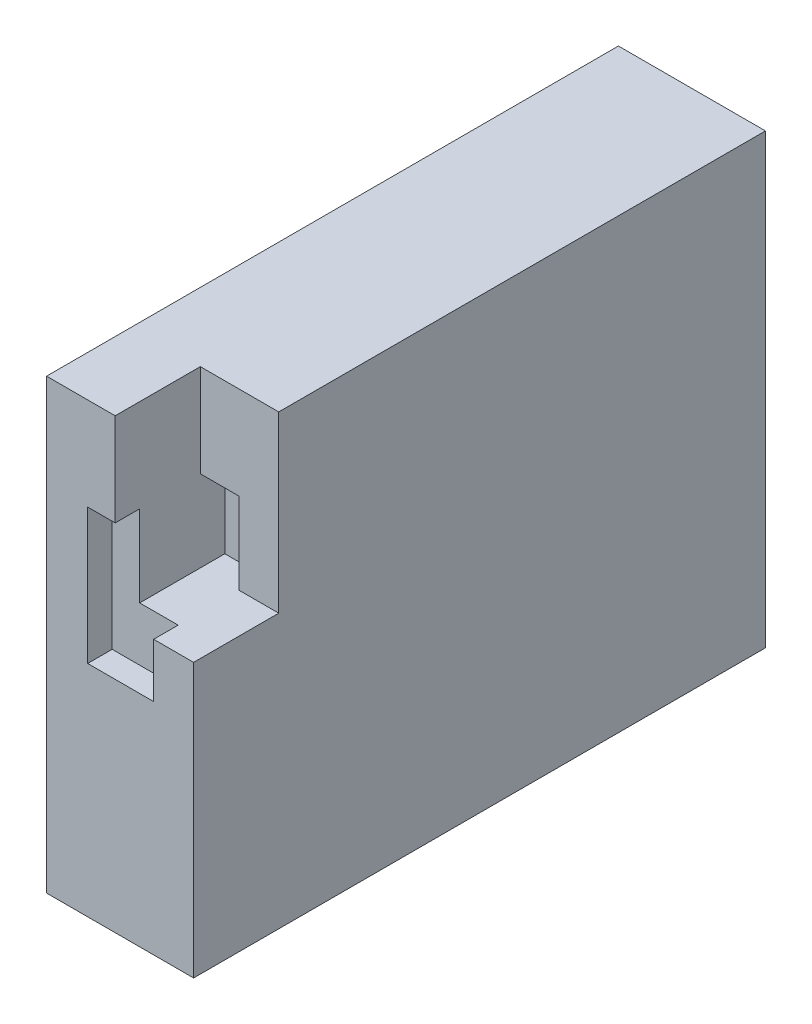
ISO-10303-21;
HEADER;
FILE_DESCRIPTION(('STEP AP214'),'2;1');
FILE_NAME('part.step','',(''),(''),'','','');
FILE_SCHEMA(('AUTOMOTIVE_DESIGN { 1 0 10303 214 1 1 1 1 }'));
ENDSEC;
DATA;
#1=APPLICATION_CONTEXT('core data for automotive mechanical design processes');
#2=APPLICATION_PROTOCOL_DEFINITION('international standard','automotive_design',2000,#1);
#3=PRODUCT_CONTEXT('',#1,'mechanical');
#4=PRODUCT('Part','Part','',(#3));
#5=PRODUCT_RELATED_PRODUCT_CATEGORY('part','',(#4));
#6=PRODUCT_DEFINITION_FORMATION('','',#4);
#7=PRODUCT_DEFINITION_CONTEXT('part definition',#1,'design');
#8=PRODUCT_DEFINITION('design','',#6,#7);
#9=PRODUCT_DEFINITION_SHAPE('','',#8);
#10=(LENGTH_UNIT() NAMED_UNIT(*) SI_UNIT(.MILLI.,.METRE.));
#11=(NAMED_UNIT(*) PLANE_ANGLE_UNIT() SI_UNIT($,.RADIAN.));
#12=(NAMED_UNIT(*) SI_UNIT($,.STERADIAN.) SOLID_ANGLE_UNIT());
#13=UNCERTAINTY_MEASURE_WITH_UNIT(LENGTH_MEASURE(1.E-05),#10,'distance_accuracy_value','');
#14=(GEOMETRIC_REPRESENTATION_CONTEXT(3) GLOBAL_UNCERTAINTY_ASSIGNED_CONTEXT((#13)) GLOBAL_UNIT_ASSIGNED_CONTEXT((#10,
#11,#12)) REPRESENTATION_CONTEXT('',''));
#15=CARTESIAN_POINT('',(0.,0.,0.));
#16=DIRECTION('',(0.,0.,1.));
#17=DIRECTION('',(1.,0.,0.));
#18=AXIS2_PLACEMENT_3D('',#15,#16,#17);
#19=CARTESIAN_POINT('',(30.,-45.6651997098228,58.3306113341758));
#20=DIRECTION('',(0.,0.,-1.));
#21=DIRECTION('',(-1.,0.,0.));
#22=AXIS2_PLACEMENT_3D('',#19,#20,#21);
#23=PLANE('',#22);
#24=DIRECTION('',(1.,0.,0.));
#25=VECTOR('',#24,1.);
#26=CARTESIAN_POINT('',(14.,10.1038000828281,58.3306113341758));
#27=LINE('',#26,#25);
#28=CARTESIAN_POINT('',(21.8487380020899,10.1038000828281,58.3306113341758));
#29=VERTEX_POINT('',#28);
#30=CARTESIAN_POINT('',(30.,10.1038000828281,58.3306113341758));
#31=VERTEX_POINT('',#30);
#32=EDGE_CURVE('E212',#29,#31,#27,.T.);
#33=ORIENTED_EDGE('',*,*,#32,.F.);
#34=DIRECTION('',(0.,1.,0.));
#35=VECTOR('',#34,1.);
#36=CARTESIAN_POINT('',(21.8487380020899,26.7341088678074,58.3306113341758));
#37=LINE('',#36,#35);
#38=CARTESIAN_POINT('',(21.8487380020899,-0.901149737116721,58.3306113341758));
#39=VERTEX_POINT('',#38);
#40=EDGE_CURVE('E323',#39,#29,#37,.T.);
#41=ORIENTED_EDGE('',*,*,#40,.F.);
#42=DIRECTION('',(1.,0.,0.));
#43=VECTOR('',#42,1.);
#44=CARTESIAN_POINT('',(8.39156859447467,-0.901149737116721,58.3306113341758));
#45=LINE('',#44,#43);
#46=CARTESIAN_POINT('',(8.39156859447467,-0.901149737116721,58.3306113341758));
#47=VERTEX_POINT('',#46);
#48=EDGE_CURVE('E305',#47,#39,#45,.T.);
#49=ORIENTED_EDGE('',*,*,#48,.F.);
#50=DIRECTION('',(0.,-1.,0.));
#51=VECTOR('',#50,1.);
#52=CARTESIAN_POINT('',(8.39156859447467,26.7341088678074,58.3306113341758));
#53=LINE('',#52,#51);
#54=CARTESIAN_POINT('',(8.39156859447467,26.7341088678074,58.3306113341758));
#55=VERTEX_POINT('',#54);
#56=EDGE_CURVE('E316',#55,#47,#53,.T.);
#57=ORIENTED_EDGE('',*,*,#56,.F.);
#58=DIRECTION('',(-1.,0.,0.));
#59=VECTOR('',#58,1.);
#60=CARTESIAN_POINT('',(8.39156859447467,26.7341088678074,58.3306113341758));
#61=LINE('',#60,#59);
#62=CARTESIAN_POINT('',(14.,26.7341088678074,58.3306113341758));
#63=VERTEX_POINT('',#62);
#64=EDGE_CURVE('E312',#63,#55,#61,.T.);
#65=ORIENTED_EDGE('',*,*,#64,.F.);
#66=DIRECTION('',(0.,-1.,0.));
#67=VECTOR('',#66,1.);
#68=CARTESIAN_POINT('',(14.,45.6651997098228,58.3306113341758));
#69=LINE('',#68,#67);
#70=CARTESIAN_POINT('',(14.,45.6651997098228,58.3306113341758));
#71=VERTEX_POINT('',#70);
#72=EDGE_CURVE('E353',#71,#63,#69,.T.);
#73=ORIENTED_EDGE('',*,*,#72,.F.);
#74=DIRECTION('',(-1.,0.,0.));
#75=VECTOR('',#74,1.);
#76=CARTESIAN_POINT('',(30.,45.6651997098228,58.3306113341758));
#77=LINE('',#76,#75);
#78=CARTESIAN_POINT('',(0.,45.6651997098228,58.3306113341758));
#79=VERTEX_POINT('',#78);
#80=EDGE_CURVE('E387',#71,#79,#77,.T.);
#81=ORIENTED_EDGE('',*,*,#80,.T.);
#82=DIRECTION('',(0.,-1.,0.));
#83=VECTOR('',#82,1.);
#84=CARTESIAN_POINT('',(0.,-45.6651997098228,58.3306113341758));
#85=LINE('',#84,#83);
#86=CARTESIAN_POINT('',(0.,-45.6651997098228,58.3306113341758));
#87=VERTEX_POINT('',#86);
#88=EDGE_CURVE('E371',#79,#87,#85,.T.);
#89=ORIENTED_EDGE('',*,*,#88,.T.);
#90=DIRECTION('',(-1.,0.,0.));
#91=VECTOR('',#90,1.);
#92=CARTESIAN_POINT('',(30.,-45.6651997098228,58.3306113341758));
#93=LINE('',#92,#91);
#94=CARTESIAN_POINT('',(30.,-45.6651997098228,58.3306113341758));
#95=VERTEX_POINT('',#94);
#96=EDGE_CURVE('E404',#95,#87,#93,.T.);
#97=ORIENTED_EDGE('',*,*,#96,.F.);
#98=DIRECTION('',(0.,-1.,0.));
#99=VECTOR('',#98,1.);
#100=CARTESIAN_POINT('',(30.,-45.6651997098228,58.3306113341758));
#101=LINE('',#100,#99);
#102=EDGE_CURVE('E376',#31,#95,#101,.T.);
#103=ORIENTED_EDGE('',*,*,#102,.F.);
#104=EDGE_LOOP('',(#33,#41,#49,#57,#65,#73,#81,#89,#97,#103));
#105=FACE_BOUND('',#104,.T.);
#106=ADVANCED_FACE('F188',(#105),#23,.F.);
#107=CARTESIAN_POINT('',(30.,-45.6651997098228,-58.3306113341758));
#108=DIRECTION('',(0.,1.,0.));
#109=DIRECTION('',(0.,0.,1.));
#110=AXIS2_PLACEMENT_3D('',#107,#108,#109);
#111=PLANE('',#110);
#112=DIRECTION('',(0.,0.,-1.));
#113=VECTOR('',#112,1.);
#114=CARTESIAN_POINT('',(0.,-45.6651997098228,-58.3306113341758));
#115=LINE('',#114,#113);
#116=CARTESIAN_POINT('',(0.,-45.6651997098228,-58.3306113341758));
#117=VERTEX_POINT('',#116);
#118=EDGE_CURVE('E390',#87,#117,#115,.T.);
#119=ORIENTED_EDGE('',*,*,#118,.T.);
#120=DIRECTION('',(-1.,0.,0.));
#121=VECTOR('',#120,1.);
#122=CARTESIAN_POINT('',(30.,-45.6651997098228,-58.3306113341758));
#123=LINE('',#122,#121);
#124=CARTESIAN_POINT('',(30.,-45.6651997098228,-58.3306113341758));
#125=VERTEX_POINT('',#124);
#126=EDGE_CURVE('E401',#125,#117,#123,.T.);
#127=ORIENTED_EDGE('',*,*,#126,.F.);
#128=DIRECTION('',(0.,0.,-1.));
#129=VECTOR('',#128,1.);
#130=CARTESIAN_POINT('',(30.,-45.6651997098228,-58.3306113341758));
#131=LINE('',#130,#129);
#132=EDGE_CURVE('E379',#95,#125,#131,.T.);
#133=ORIENTED_EDGE('',*,*,#132,.F.);
#134=ORIENTED_EDGE('',*,*,#96,.T.);
#135=EDGE_LOOP('',(#119,#127,#133,#134));
#136=FACE_BOUND('',#135,.T.);
#137=ADVANCED_FACE('F431',(#136),#111,.F.);
#138=CARTESIAN_POINT('',(30.,-45.6651997098228,-58.3306113341758));
#139=DIRECTION('',(0.,0.,1.));
#140=DIRECTION('',(1.,0.,0.));
#141=AXIS2_PLACEMENT_3D('',#138,#139,#140);
#142=PLANE('',#141);
#143=DIRECTION('',(0.,1.,0.));
#144=VECTOR('',#143,1.);
#145=CARTESIAN_POINT('',(0.,-45.6651997098228,-58.3306113341758));
#146=LINE('',#145,#144);
#147=CARTESIAN_POINT('',(0.,45.6651997098228,-58.3306113341758));
#148=VERTEX_POINT('',#147);
#149=EDGE_CURVE('E392',#117,#148,#146,.T.);
#150=ORIENTED_EDGE('',*,*,#149,.T.);
#151=DIRECTION('',(-1.,0.,0.));
#152=VECTOR('',#151,1.);
#153=CARTESIAN_POINT('',(30.,45.6651997098228,-58.3306113341758));
#154=LINE('',#153,#152);
#155=CARTESIAN_POINT('',(30.,45.6651997098228,-58.3306113341758));
#156=VERTEX_POINT('',#155);
#157=EDGE_CURVE('E398',#156,#148,#154,.T.);
#158=ORIENTED_EDGE('',*,*,#157,.F.);
#159=DIRECTION('',(0.,1.,0.));
#160=VECTOR('',#159,1.);
#161=CARTESIAN_POINT('',(30.,-45.6651997098228,-58.3306113341758));
#162=LINE('',#161,#160);
#163=EDGE_CURVE('E382',#125,#156,#162,.T.);
#164=ORIENTED_EDGE('',*,*,#163,.F.);
#165=ORIENTED_EDGE('',*,*,#126,.T.);
#166=EDGE_LOOP('',(#150,#158,#164,#165));
#167=FACE_BOUND('',#166,.T.);
#168=ADVANCED_FACE('F484',(#167),#142,.F.);
#169=CARTESIAN_POINT('',(30.,45.6651997098228,-58.3306113341758));
#170=DIRECTION('',(0.,-1.,0.));
#171=DIRECTION('',(0.,0.,-1.));
#172=AXIS2_PLACEMENT_3D('',#169,#170,#171);
#173=PLANE('',#172);
#174=DIRECTION('',(0.,0.,1.));
#175=VECTOR('',#174,1.);
#176=CARTESIAN_POINT('',(14.,45.6651997098228,58.3306113341758));
#177=LINE('',#176,#175);
#178=CARTESIAN_POINT('',(14.,45.6651997098228,40.9613516871404));
#179=VERTEX_POINT('',#178);
#180=EDGE_CURVE('E362',#179,#71,#177,.T.);
#181=ORIENTED_EDGE('',*,*,#180,.F.);
#182=DIRECTION('',(1.,0.,0.));
#183=VECTOR('',#182,1.);
#184=CARTESIAN_POINT('',(14.,45.6651997098228,40.9613516871404));
#185=LINE('',#184,#183);
#186=CARTESIAN_POINT('',(30.,45.6651997098228,40.9613516871404));
#187=VERTEX_POINT('',#186);
#188=EDGE_CURVE('E368',#179,#187,#185,.T.);
#189=ORIENTED_EDGE('',*,*,#188,.T.);
#190=DIRECTION('',(0.,0.,1.));
#191=VECTOR('',#190,1.);
#192=CARTESIAN_POINT('',(30.,45.6651997098228,-58.3306113341758));
#193=LINE('',#192,#191);
#194=EDGE_CURVE('E384',#156,#187,#193,.T.);
#195=ORIENTED_EDGE('',*,*,#194,.F.);
#196=ORIENTED_EDGE('',*,*,#157,.T.);
#197=DIRECTION('',(0.,0.,1.));
#198=VECTOR('',#197,1.);
#199=CARTESIAN_POINT('',(0.,45.6651997098228,-58.3306113341758));
#200=LINE('',#199,#198);
#201=EDGE_CURVE('E380',#148,#79,#200,.T.);
#202=ORIENTED_EDGE('',*,*,#201,.T.);
#203=ORIENTED_EDGE('',*,*,#80,.F.);
#204=EDGE_LOOP('',(#181,#189,#195,#196,#202,#203));
#205=FACE_BOUND('',#204,.T.);
#206=ADVANCED_FACE('F419',(#205),#173,.F.);
#207=CARTESIAN_POINT('',(30.,45.6651997098228,58.3306113341758));
#208=DIRECTION('',(1.,0.,0.));
#209=DIRECTION('',(0.,0.,-1.));
#210=AXIS2_PLACEMENT_3D('',#207,#208,#209);
#211=PLANE('',#210);
#212=DIRECTION('',(0.,1.,0.));
#213=VECTOR('',#212,1.);
#214=CARTESIAN_POINT('',(30.,45.6651997098228,40.9613516871404));
#215=LINE('',#214,#213);
#216=CARTESIAN_POINT('',(30.,10.1038000828281,40.9613516871404));
#217=VERTEX_POINT('',#216);
#218=EDGE_CURVE('E357',#217,#187,#215,.T.);
#219=ORIENTED_EDGE('',*,*,#218,.F.);
#220=DIRECTION('',(0.,0.,-1.));
#221=VECTOR('',#220,1.);
#222=CARTESIAN_POINT('',(30.,10.1038000828281,58.3306113341758));
#223=LINE('',#222,#221);
#224=EDGE_CURVE('E352',#31,#217,#223,.T.);
#225=ORIENTED_EDGE('',*,*,#224,.F.);
#226=ORIENTED_EDGE('',*,*,#102,.T.);
#227=ORIENTED_EDGE('',*,*,#132,.T.);
#228=ORIENTED_EDGE('',*,*,#163,.T.);
#229=ORIENTED_EDGE('',*,*,#194,.T.);
#230=EDGE_LOOP('',(#219,#225,#226,#227,#228,#229));
#231=FACE_BOUND('',#230,.T.);
#232=ADVANCED_FACE('F435',(#231),#211,.T.);
#233=CARTESIAN_POINT('',(0.,45.6651997098228,58.3306113341758));
#234=DIRECTION('',(1.,0.,0.));
#235=DIRECTION('',(0.,0.,-1.));
#236=AXIS2_PLACEMENT_3D('',#233,#234,#235);
#237=PLANE('',#236);
#238=ORIENTED_EDGE('',*,*,#88,.F.);
#239=ORIENTED_EDGE('',*,*,#201,.F.);
#240=ORIENTED_EDGE('',*,*,#149,.F.);
#241=ORIENTED_EDGE('',*,*,#118,.F.);
#242=EDGE_LOOP('',(#238,#239,#240,#241));
#243=FACE_BOUND('',#242,.T.);
#244=ADVANCED_FACE('F426',(#243),#237,.F.);
#245=CARTESIAN_POINT('',(14.,45.6651997098228,40.9613516871404));
#246=DIRECTION('',(0.,0.,-1.));
#247=DIRECTION('',(-1.,0.,0.));
#248=AXIS2_PLACEMENT_3D('',#245,#246,#247);
#249=PLANE('',#248);
#250=DIRECTION('',(1.,0.,0.));
#251=VECTOR('',#250,1.);
#252=CARTESIAN_POINT('',(14.,26.7341088678074,40.9613516871404));
#253=LINE('',#252,#251);
#254=CARTESIAN_POINT('',(14.,26.7341088678074,40.9613516871404));
#255=VERTEX_POINT('',#254);
#256=CARTESIAN_POINT('',(21.8487380020899,26.7341088678074,40.9613516871404));
#257=VERTEX_POINT('',#256);
#258=EDGE_CURVE('E345',#255,#257,#253,.T.);
#259=ORIENTED_EDGE('',*,*,#258,.T.);
#260=DIRECTION('',(0.,-1.,0.));
#261=VECTOR('',#260,1.);
#262=CARTESIAN_POINT('',(21.8487380020899,45.6651997098228,40.9613516871404));
#263=LINE('',#262,#261);
#264=CARTESIAN_POINT('',(21.8487380020899,10.1038000828281,40.9613516871404));
#265=VERTEX_POINT('',#264);
#266=EDGE_CURVE('E348',#257,#265,#263,.T.);
#267=ORIENTED_EDGE('',*,*,#266,.T.);
#268=DIRECTION('',(1.,0.,0.));
#269=VECTOR('',#268,1.);
#270=CARTESIAN_POINT('',(14.,10.1038000828281,40.9613516871404));
#271=LINE('',#270,#269);
#272=EDGE_CURVE('E372',#265,#217,#271,.T.);
#273=ORIENTED_EDGE('',*,*,#272,.T.);
#274=ORIENTED_EDGE('',*,*,#218,.T.);
#275=ORIENTED_EDGE('',*,*,#188,.F.);
#276=DIRECTION('',(0.,1.,0.));
#277=VECTOR('',#276,1.);
#278=CARTESIAN_POINT('',(14.,45.6651997098228,40.9613516871404));
#279=LINE('',#278,#277);
#280=EDGE_CURVE('E360',#255,#179,#279,.T.);
#281=ORIENTED_EDGE('',*,*,#280,.F.);
#282=EDGE_LOOP('',(#259,#267,#273,#274,#275,#281));
#283=FACE_BOUND('',#282,.T.);
#284=ADVANCED_FACE('F442',(#283),#249,.F.);
#285=CARTESIAN_POINT('',(14.,10.1038000828281,58.3306113341758));
#286=DIRECTION('',(0.,-1.,0.));
#287=DIRECTION('',(0.,0.,-1.));
#288=AXIS2_PLACEMENT_3D('',#285,#286,#287);
#289=PLANE('',#288);
#290=ORIENTED_EDGE('',*,*,#272,.F.);
#291=DIRECTION('',(0.,0.,-1.));
#292=VECTOR('',#291,1.);
#293=CARTESIAN_POINT('',(21.8487380020899,10.1038000828281,-68.3316113341758));
#294=LINE('',#293,#292);
#295=CARTESIAN_POINT('',(21.8487380020899,10.1038000828281,35.9613516871404));
#296=VERTEX_POINT('',#295);
#297=EDGE_CURVE('E340',#265,#296,#294,.T.);
#298=ORIENTED_EDGE('',*,*,#297,.T.);
#299=DIRECTION('',(1.,0.,0.));
#300=VECTOR('',#299,1.);
#301=CARTESIAN_POINT('',(14.,10.1038000828281,35.9613516871404));
#302=LINE('',#301,#300);
#303=CARTESIAN_POINT('',(14.,10.1038000828281,35.9613516871404));
#304=VERTEX_POINT('',#303);
#305=EDGE_CURVE('E349',#304,#296,#302,.T.);
#306=ORIENTED_EDGE('',*,*,#305,.F.);
#307=DIRECTION('',(0.,0.,-1.));
#308=VECTOR('',#307,1.);
#309=CARTESIAN_POINT('',(14.,10.1038000828281,58.3306113341758));
#310=LINE('',#309,#308);
#311=CARTESIAN_POINT('',(14.,10.1038000828281,53.3306113341758));
#312=VERTEX_POINT('',#311);
#313=EDGE_CURVE('E356',#312,#304,#310,.T.);
#314=ORIENTED_EDGE('',*,*,#313,.F.);
#315=DIRECTION('',(1.,0.,0.));
#316=VECTOR('',#315,1.);
#317=CARTESIAN_POINT('',(14.,10.1038000828281,53.3306113341758));
#318=LINE('',#317,#316);
#319=CARTESIAN_POINT('',(21.8487380020899,10.1038000828281,53.3306113341758));
#320=VERTEX_POINT('',#319);
#321=EDGE_CURVE('E203',#312,#320,#318,.T.);
#322=ORIENTED_EDGE('',*,*,#321,.T.);
#323=DIRECTION('',(0.,0.,1.));
#324=VECTOR('',#323,1.);
#325=CARTESIAN_POINT('',(21.8487380020899,10.1038000828281,58.3306113341758));
#326=LINE('',#325,#324);
#327=EDGE_CURVE('E52',#320,#29,#326,.T.);
#328=ORIENTED_EDGE('',*,*,#327,.T.);
#329=ORIENTED_EDGE('',*,*,#32,.T.);
#330=ORIENTED_EDGE('',*,*,#224,.T.);
#331=EDGE_LOOP('',(#290,#298,#306,#314,#322,#328,#329,#330));
#332=FACE_BOUND('',#331,.T.);
#333=ADVANCED_FACE('F438',(#332),#289,.F.);
#334=CARTESIAN_POINT('',(14.,10.1038000828281,58.3306113341758));
#335=DIRECTION('',(1.,0.,0.));
#336=DIRECTION('',(0.,0.,-1.));
#337=AXIS2_PLACEMENT_3D('',#334,#335,#336);
#338=PLANE('',#337);
#339=DIRECTION('',(0.,0.,1.));
#340=VECTOR('',#339,1.);
#341=CARTESIAN_POINT('',(14.,26.7341088678074,58.3306113341758));
#342=LINE('',#341,#340);
#343=CARTESIAN_POINT('',(14.,26.7341088678074,53.3306113341758));
#344=VERTEX_POINT('',#343);
#345=EDGE_CURVE('E196',#344,#63,#342,.T.);
#346=ORIENTED_EDGE('',*,*,#345,.F.);
#347=DIRECTION('',(0.,-1.,0.));
#348=VECTOR('',#347,1.);
#349=CARTESIAN_POINT('',(14.,45.6651997098228,53.3306113341758));
#350=LINE('',#349,#348);
#351=EDGE_CURVE('E456',#344,#312,#350,.T.);
#352=ORIENTED_EDGE('',*,*,#351,.T.);
#353=ORIENTED_EDGE('',*,*,#313,.T.);
#354=DIRECTION('',(0.,1.,0.));
#355=VECTOR('',#354,1.);
#356=CARTESIAN_POINT('',(14.,45.6651997098228,35.9613516871404));
#357=LINE('',#356,#355);
#358=CARTESIAN_POINT('',(14.,26.7341088678074,35.9613516871404));
#359=VERTEX_POINT('',#358);
#360=EDGE_CURVE('E460',#304,#359,#357,.T.);
#361=ORIENTED_EDGE('',*,*,#360,.T.);
#362=DIRECTION('',(0.,0.,-1.));
#363=VECTOR('',#362,1.);
#364=CARTESIAN_POINT('',(14.,26.7341088678074,-68.3316113341758));
#365=LINE('',#364,#363);
#366=EDGE_CURVE('E342',#255,#359,#365,.T.);
#367=ORIENTED_EDGE('',*,*,#366,.F.);
#368=ORIENTED_EDGE('',*,*,#280,.T.);
#369=ORIENTED_EDGE('',*,*,#180,.T.);
#370=ORIENTED_EDGE('',*,*,#72,.T.);
#371=EDGE_LOOP('',(#346,#352,#353,#361,#367,#368,#369,#370));
#372=FACE_BOUND('',#371,.T.);
#373=ADVANCED_FACE('F413',(#372),#338,.T.);
#374=CARTESIAN_POINT('',(30.,-45.6651997098228,53.3306113341758));
#375=DIRECTION('',(0.,0.,-1.));
#376=DIRECTION('',(-1.,0.,0.));
#377=AXIS2_PLACEMENT_3D('',#374,#375,#376);
#378=PLANE('',#377);
#379=ORIENTED_EDGE('',*,*,#351,.F.);
#380=DIRECTION('',(-1.,0.,0.));
#381=VECTOR('',#380,1.);
#382=CARTESIAN_POINT('',(8.39156859447467,26.7341088678074,53.3306113341758));
#383=LINE('',#382,#381);
#384=CARTESIAN_POINT('',(8.39156859447467,26.7341088678074,53.3306113341758));
#385=VERTEX_POINT('',#384);
#386=EDGE_CURVE('E344',#344,#385,#383,.T.);
#387=ORIENTED_EDGE('',*,*,#386,.T.);
#388=DIRECTION('',(0.,-1.,0.));
#389=VECTOR('',#388,1.);
#390=CARTESIAN_POINT('',(8.39156859447467,26.7341088678074,53.3306113341758));
#391=LINE('',#390,#389);
#392=CARTESIAN_POINT('',(8.39156859447467,-0.901149737116721,53.3306113341758));
#393=VERTEX_POINT('',#392);
#394=EDGE_CURVE('E454',#385,#393,#391,.T.);
#395=ORIENTED_EDGE('',*,*,#394,.T.);
#396=DIRECTION('',(1.,0.,0.));
#397=VECTOR('',#396,1.);
#398=CARTESIAN_POINT('',(8.39156859447467,-0.901149737116721,53.3306113341758));
#399=LINE('',#398,#397);
#400=CARTESIAN_POINT('',(21.8487380020899,-0.901149737116721,53.3306113341758));
#401=VERTEX_POINT('',#400);
#402=EDGE_CURVE('E308',#393,#401,#399,.T.);
#403=ORIENTED_EDGE('',*,*,#402,.T.);
#404=DIRECTION('',(0.,1.,0.));
#405=VECTOR('',#404,1.);
#406=CARTESIAN_POINT('',(21.8487380020899,26.7341088678074,53.3306113341758));
#407=LINE('',#406,#405);
#408=EDGE_CURVE('E335',#401,#320,#407,.T.);
#409=ORIENTED_EDGE('',*,*,#408,.T.);
#410=ORIENTED_EDGE('',*,*,#321,.F.);
#411=EDGE_LOOP('',(#379,#387,#395,#403,#409,#410));
#412=FACE_BOUND('',#411,.T.);
#413=ADVANCED_FACE('F470',(#412),#378,.F.);
#414=CARTESIAN_POINT('',(8.39156859447467,26.7341088678074,-68.3316113341758));
#415=DIRECTION('',(0.,1.,0.));
#416=DIRECTION('',(0.,0.,1.));
#417=AXIS2_PLACEMENT_3D('',#414,#415,#416);
#418=PLANE('',#417);
#419=ORIENTED_EDGE('',*,*,#345,.T.);
#420=ORIENTED_EDGE('',*,*,#64,.T.);
#421=DIRECTION('',(0.,0.,1.));
#422=VECTOR('',#421,1.);
#423=CARTESIAN_POINT('',(8.39156859447467,26.7341088678074,-68.3316113341758));
#424=LINE('',#423,#422);
#425=EDGE_CURVE('E319',#385,#55,#424,.T.);
#426=ORIENTED_EDGE('',*,*,#425,.F.);
#427=ORIENTED_EDGE('',*,*,#386,.F.);
#428=EDGE_LOOP('',(#419,#420,#426,#427));
#429=FACE_BOUND('',#428,.T.);
#430=ADVANCED_FACE('F408',(#429),#418,.F.);
#431=CARTESIAN_POINT('',(21.8487380020899,26.7341088678074,-68.3316113341758));
#432=DIRECTION('',(1.,0.,0.));
#433=DIRECTION('',(0.,0.,-1.));
#434=AXIS2_PLACEMENT_3D('',#431,#432,#433);
#435=PLANE('',#434);
#436=ORIENTED_EDGE('',*,*,#408,.F.);
#437=DIRECTION('',(0.,0.,1.));
#438=VECTOR('',#437,1.);
#439=CARTESIAN_POINT('',(21.8487380020899,-0.901149737116721,-68.3316113341758));
#440=LINE('',#439,#438);
#441=EDGE_CURVE('E311',#401,#39,#440,.T.);
#442=ORIENTED_EDGE('',*,*,#441,.T.);
#443=ORIENTED_EDGE('',*,*,#40,.T.);
#444=ORIENTED_EDGE('',*,*,#327,.F.);
#445=EDGE_LOOP('',(#436,#442,#443,#444));
#446=FACE_BOUND('',#445,.T.);
#447=ADVANCED_FACE('F469',(#446),#435,.F.);
#448=CARTESIAN_POINT('',(8.39156859447467,26.7341088678074,-68.3316113341758));
#449=DIRECTION('',(-1.,0.,0.));
#450=DIRECTION('',(0.,0.,1.));
#451=AXIS2_PLACEMENT_3D('',#448,#449,#450);
#452=PLANE('',#451);
#453=ORIENTED_EDGE('',*,*,#425,.T.);
#454=ORIENTED_EDGE('',*,*,#56,.T.);
#455=DIRECTION('',(0.,0.,1.));
#456=VECTOR('',#455,1.);
#457=CARTESIAN_POINT('',(8.39156859447467,-0.901149737116721,-68.3316113341758));
#458=LINE('',#457,#456);
#459=EDGE_CURVE('E300',#393,#47,#458,.T.);
#460=ORIENTED_EDGE('',*,*,#459,.F.);
#461=ORIENTED_EDGE('',*,*,#394,.F.);
#462=EDGE_LOOP('',(#453,#454,#460,#461));
#463=FACE_BOUND('',#462,.T.);
#464=ADVANCED_FACE('F317',(#463),#452,.F.);
#465=CARTESIAN_POINT('',(8.39156859447467,-0.901149737116721,-68.3316113341758));
#466=DIRECTION('',(0.,-1.,0.));
#467=DIRECTION('',(0.,0.,-1.));
#468=AXIS2_PLACEMENT_3D('',#465,#466,#467);
#469=PLANE('',#468);
#470=ORIENTED_EDGE('',*,*,#459,.T.);
#471=ORIENTED_EDGE('',*,*,#48,.T.);
#472=ORIENTED_EDGE('',*,*,#441,.F.);
#473=ORIENTED_EDGE('',*,*,#402,.F.);
#474=EDGE_LOOP('',(#470,#471,#472,#473));
#475=FACE_BOUND('',#474,.T.);
#476=ADVANCED_FACE('F302',(#475),#469,.F.);
#477=DIRECTION('',(0.,0.,1.));
#478=VECTOR('',#477,1.);
#479=CARTESIAN_POINT('',(21.8487380020899,26.7341088678074,-68.3316113341758));
#480=LINE('',#479,#478);
#481=CARTESIAN_POINT('',(21.8487380020899,26.7341088678074,35.9613516871405));
#482=VERTEX_POINT('',#481);
#483=EDGE_CURVE('E330',#482,#257,#480,.T.);
#484=ORIENTED_EDGE('',*,*,#483,.F.);
#485=DIRECTION('',(0.,1.,0.));
#486=VECTOR('',#485,1.);
#487=CARTESIAN_POINT('',(21.8487380020899,26.7341088678074,35.9613516871405));
#488=LINE('',#487,#486);
#489=EDGE_CURVE('E336',#296,#482,#488,.T.);
#490=ORIENTED_EDGE('',*,*,#489,.F.);
#491=ORIENTED_EDGE('',*,*,#297,.F.);
#492=ORIENTED_EDGE('',*,*,#266,.F.);
#493=EDGE_LOOP('',(#484,#490,#491,#492));
#494=FACE_BOUND('',#493,.T.);
#495=ADVANCED_FACE('F445',(#494),#435,.F.);
#496=ORIENTED_EDGE('',*,*,#366,.T.);
#497=DIRECTION('',(-1.,0.,0.));
#498=VECTOR('',#497,1.);
#499=CARTESIAN_POINT('',(8.39156859447467,26.7341088678074,35.9613516871405));
#500=LINE('',#499,#498);
#501=EDGE_CURVE('E339',#482,#359,#500,.T.);
#502=ORIENTED_EDGE('',*,*,#501,.F.);
#503=ORIENTED_EDGE('',*,*,#483,.T.);
#504=ORIENTED_EDGE('',*,*,#258,.F.);
#505=EDGE_LOOP('',(#496,#502,#503,#504));
#506=FACE_BOUND('',#505,.T.);
#507=ADVANCED_FACE('F447',(#506),#418,.F.);
#508=CARTESIAN_POINT('',(14.,45.6651997098228,35.9613516871404));
#509=DIRECTION('',(0.,0.,-1.));
#510=DIRECTION('',(-1.,0.,0.));
#511=AXIS2_PLACEMENT_3D('',#508,#509,#510);
#512=PLANE('',#511);
#513=ORIENTED_EDGE('',*,*,#489,.T.);
#514=ORIENTED_EDGE('',*,*,#501,.T.);
#515=ORIENTED_EDGE('',*,*,#360,.F.);
#516=ORIENTED_EDGE('',*,*,#305,.T.);
#517=EDGE_LOOP('',(#513,#514,#515,#516));
#518=FACE_BOUND('',#517,.T.);
#519=ADVANCED_FACE('F467',(#518),#512,.F.);
#520=CLOSED_SHELL('',(#106,#137,#168,#206,#232,#244,#284,#333,#373,#413,#430,#447,#464,#476,
#495,#507,#519));
#521=MANIFOLD_SOLID_BREP('B7',#520);
#522=ADVANCED_BREP_SHAPE_REPRESENTATION('',(#18,#521),#14);
#523=SHAPE_DEFINITION_REPRESENTATION(#9,#522);
ENDSEC;
END-ISO-10303-21;
